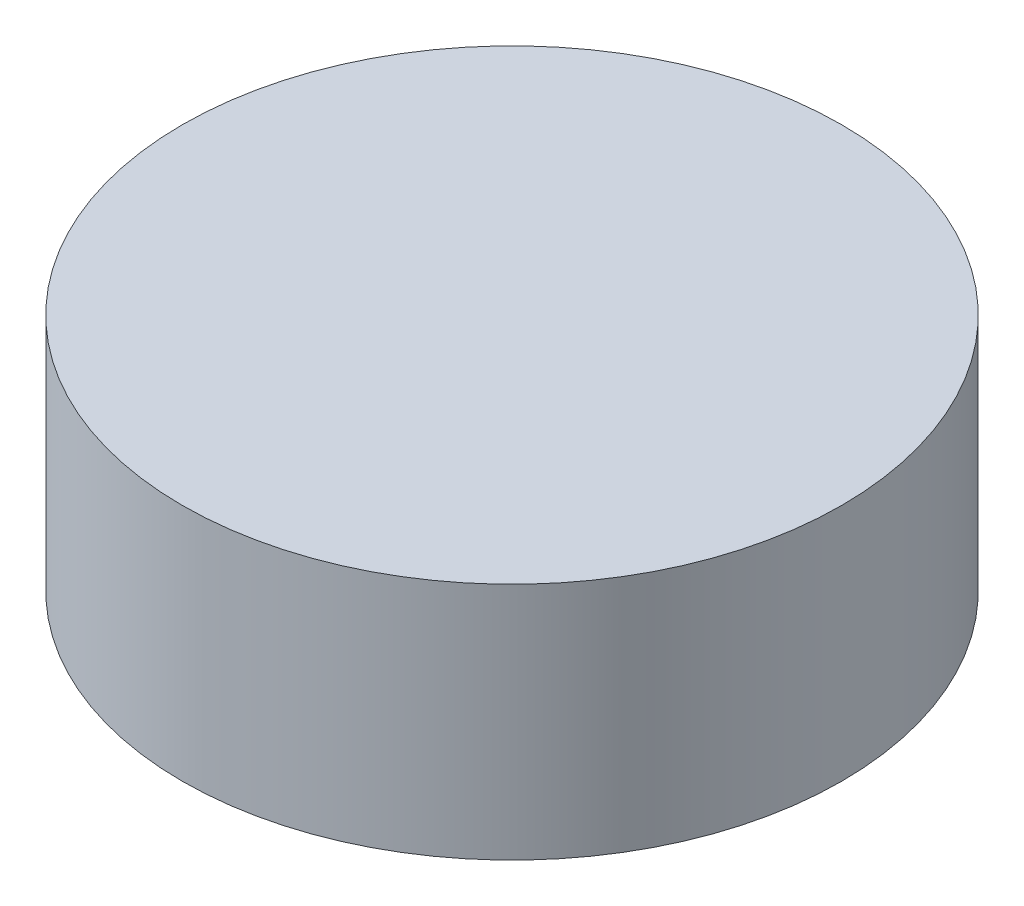
ISO-10303-21;
HEADER;
FILE_DESCRIPTION(('STEP AP214'),'2;1');
FILE_NAME('part.step','',(''),(''),'','','');
FILE_SCHEMA(('AUTOMOTIVE_DESIGN { 1 0 10303 214 1 1 1 1 }'));
ENDSEC;
DATA;
#1=APPLICATION_CONTEXT('core data for automotive mechanical design processes');
#2=APPLICATION_PROTOCOL_DEFINITION('international standard','automotive_design',2000,#1);
#3=PRODUCT_CONTEXT('',#1,'mechanical');
#4=PRODUCT('Part','Part','',(#3));
#5=PRODUCT_RELATED_PRODUCT_CATEGORY('part','',(#4));
#6=PRODUCT_DEFINITION_FORMATION('','',#4);
#7=PRODUCT_DEFINITION_CONTEXT('part definition',#1,'design');
#8=PRODUCT_DEFINITION('design','',#6,#7);
#9=PRODUCT_DEFINITION_SHAPE('','',#8);
#10=(LENGTH_UNIT() NAMED_UNIT(*) SI_UNIT(.MILLI.,.METRE.));
#11=(NAMED_UNIT(*) PLANE_ANGLE_UNIT() SI_UNIT($,.RADIAN.));
#12=(NAMED_UNIT(*) SI_UNIT($,.STERADIAN.) SOLID_ANGLE_UNIT());
#13=UNCERTAINTY_MEASURE_WITH_UNIT(LENGTH_MEASURE(1.E-05),#10,'distance_accuracy_value','');
#14=(GEOMETRIC_REPRESENTATION_CONTEXT(3) GLOBAL_UNCERTAINTY_ASSIGNED_CONTEXT((#13)) GLOBAL_UNIT_ASSIGNED_CONTEXT((#10,
#11,#12)) REPRESENTATION_CONTEXT('',''));
#15=CARTESIAN_POINT('',(0.,0.,0.));
#16=DIRECTION('',(0.,0.,1.));
#17=DIRECTION('',(1.,0.,0.));
#18=AXIS2_PLACEMENT_3D('',#15,#16,#17);
#19=CARTESIAN_POINT('',(0.,10.,0.));
#20=DIRECTION('',(0.,-1.,0.));
#21=DIRECTION('',(0.,0.,-1.));
#22=AXIS2_PLACEMENT_3D('',#19,#20,#21);
#23=CYLINDRICAL_SURFACE('',#22,13.8);
#24=CARTESIAN_POINT('',(0.,10.,0.));
#25=DIRECTION('',(0.,1.,0.));
#26=DIRECTION('',(0.,0.,1.));
#27=AXIS2_PLACEMENT_3D('',#24,#25,#26);
#28=CIRCLE('',#27,13.8);
#29=CARTESIAN_POINT('',(0.,10.,13.8));
#30=VERTEX_POINT('',#29);
#31=EDGE_CURVE('E10',#30,#30,#28,.T.);
#32=ORIENTED_EDGE('',*,*,#31,.F.);
#33=EDGE_LOOP('',(#32));
#34=FACE_BOUND('',#33,.T.);
#35=CARTESIAN_POINT('',(0.,0.,0.));
#36=DIRECTION('',(0.,1.,0.));
#37=DIRECTION('',(0.,0.,1.));
#38=AXIS2_PLACEMENT_3D('',#35,#36,#37);
#39=CIRCLE('',#38,13.8);
#40=CARTESIAN_POINT('',(0.,0.,13.8));
#41=VERTEX_POINT('',#40);
#42=EDGE_CURVE('E40',#41,#41,#39,.T.);
#43=ORIENTED_EDGE('',*,*,#42,.T.);
#44=EDGE_LOOP('',(#43));
#45=FACE_BOUND('',#44,.T.);
#46=ADVANCED_FACE('F37',(#34,#45),#23,.T.);
#47=CARTESIAN_POINT('',(0.,10.,0.));
#48=DIRECTION('',(0.,1.,0.));
#49=DIRECTION('',(0.,0.,1.));
#50=AXIS2_PLACEMENT_3D('',#47,#48,#49);
#51=PLANE('',#50);
#52=ORIENTED_EDGE('',*,*,#31,.T.);
#53=EDGE_LOOP('',(#52));
#54=FACE_BOUND('',#53,.T.);
#55=ADVANCED_FACE('F54',(#54),#51,.T.);
#56=CARTESIAN_POINT('',(0.,0.,0.));
#57=DIRECTION('',(0.,1.,0.));
#58=DIRECTION('',(0.,0.,1.));
#59=AXIS2_PLACEMENT_3D('',#56,#57,#58);
#60=PLANE('',#59);
#61=ORIENTED_EDGE('',*,*,#42,.F.);
#62=EDGE_LOOP('',(#61));
#63=FACE_BOUND('',#62,.T.);
#64=ADVANCED_FACE('F52',(#63),#60,.F.);
#65=CLOSED_SHELL('',(#46,#55,#64));
#66=MANIFOLD_SOLID_BREP('B2',#65);
#67=ADVANCED_BREP_SHAPE_REPRESENTATION('',(#18,#66),#14);
#68=SHAPE_DEFINITION_REPRESENTATION(#9,#67);
ENDSEC;
END-ISO-10303-21;
